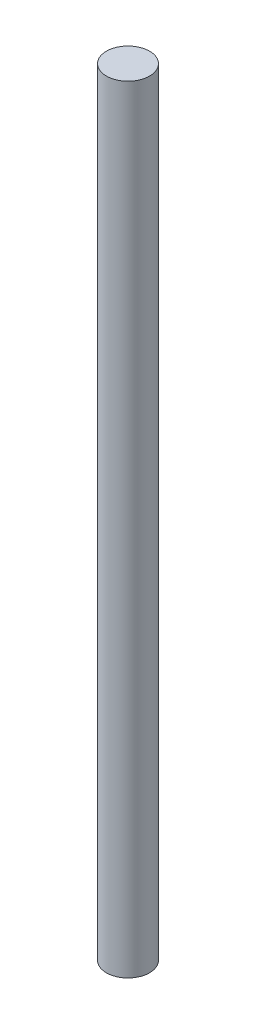
ISO-10303-21;
HEADER;
FILE_DESCRIPTION(('STEP AP214'),'2;1');
FILE_NAME('part.step','',(''),(''),'','','');
FILE_SCHEMA(('AUTOMOTIVE_DESIGN { 1 0 10303 214 1 1 1 1 }'));
ENDSEC;
DATA;
#1=APPLICATION_CONTEXT('core data for automotive mechanical design processes');
#2=APPLICATION_PROTOCOL_DEFINITION('international standard','automotive_design',2000,#1);
#3=PRODUCT_CONTEXT('',#1,'mechanical');
#4=PRODUCT('Part','Part','',(#3));
#5=PRODUCT_RELATED_PRODUCT_CATEGORY('part','',(#4));
#6=PRODUCT_DEFINITION_FORMATION('','',#4);
#7=PRODUCT_DEFINITION_CONTEXT('part definition',#1,'design');
#8=PRODUCT_DEFINITION('design','',#6,#7);
#9=PRODUCT_DEFINITION_SHAPE('','',#8);
#10=(LENGTH_UNIT() NAMED_UNIT(*) SI_UNIT(.MILLI.,.METRE.));
#11=(NAMED_UNIT(*) PLANE_ANGLE_UNIT() SI_UNIT($,.RADIAN.));
#12=(NAMED_UNIT(*) SI_UNIT($,.STERADIAN.) SOLID_ANGLE_UNIT());
#13=UNCERTAINTY_MEASURE_WITH_UNIT(LENGTH_MEASURE(1.E-05),#10,'distance_accuracy_value','');
#14=(GEOMETRIC_REPRESENTATION_CONTEXT(3) GLOBAL_UNCERTAINTY_ASSIGNED_CONTEXT((#13)) GLOBAL_UNIT_ASSIGNED_CONTEXT((#10,
#11,#12)) REPRESENTATION_CONTEXT('',''));
#15=CARTESIAN_POINT('',(0.,0.,0.));
#16=DIRECTION('',(0.,0.,1.));
#17=DIRECTION('',(1.,0.,0.));
#18=AXIS2_PLACEMENT_3D('',#15,#16,#17);
#19=CARTESIAN_POINT('',(0.,457.2,0.));
#20=DIRECTION('',(0.,-1.,0.));
#21=DIRECTION('',(0.,0.,-1.));
#22=AXIS2_PLACEMENT_3D('',#19,#20,#21);
#23=CYLINDRICAL_SURFACE('',#22,12.7);
#24=CARTESIAN_POINT('',(0.,457.2,0.));
#25=DIRECTION('',(0.,1.,0.));
#26=DIRECTION('',(0.,0.,1.));
#27=AXIS2_PLACEMENT_3D('',#24,#25,#26);
#28=CIRCLE('',#27,12.7);
#29=CARTESIAN_POINT('',(0.,457.2,12.7));
#30=VERTEX_POINT('',#29);
#31=EDGE_CURVE('E10',#30,#30,#28,.T.);
#32=ORIENTED_EDGE('',*,*,#31,.F.);
#33=EDGE_LOOP('',(#32));
#34=FACE_BOUND('',#33,.T.);
#35=CARTESIAN_POINT('',(0.,0.,0.));
#36=DIRECTION('',(0.,1.,0.));
#37=DIRECTION('',(0.,0.,1.));
#38=AXIS2_PLACEMENT_3D('',#35,#36,#37);
#39=CIRCLE('',#38,12.7);
#40=CARTESIAN_POINT('',(0.,0.,12.7));
#41=VERTEX_POINT('',#40);
#42=EDGE_CURVE('E34',#41,#41,#39,.T.);
#43=ORIENTED_EDGE('',*,*,#42,.T.);
#44=EDGE_LOOP('',(#43));
#45=FACE_BOUND('',#44,.T.);
#46=ADVANCED_FACE('F31',(#34,#45),#23,.T.);
#47=CARTESIAN_POINT('',(0.,457.2,0.));
#48=DIRECTION('',(0.,1.,0.));
#49=DIRECTION('',(0.,0.,1.));
#50=AXIS2_PLACEMENT_3D('',#47,#48,#49);
#51=PLANE('',#50);
#52=ORIENTED_EDGE('',*,*,#31,.T.);
#53=EDGE_LOOP('',(#52));
#54=FACE_BOUND('',#53,.T.);
#55=ADVANCED_FACE('F46',(#54),#51,.T.);
#56=CARTESIAN_POINT('',(0.,0.,0.));
#57=DIRECTION('',(0.,1.,0.));
#58=DIRECTION('',(0.,0.,1.));
#59=AXIS2_PLACEMENT_3D('',#56,#57,#58);
#60=PLANE('',#59);
#61=ORIENTED_EDGE('',*,*,#42,.F.);
#62=EDGE_LOOP('',(#61));
#63=FACE_BOUND('',#62,.T.);
#64=ADVANCED_FACE('F44',(#63),#60,.F.);
#65=CLOSED_SHELL('',(#46,#55,#64));
#66=MANIFOLD_SOLID_BREP('B2',#65);
#67=ADVANCED_BREP_SHAPE_REPRESENTATION('',(#18,#66),#14);
#68=SHAPE_DEFINITION_REPRESENTATION(#9,#67);
ENDSEC;
END-ISO-10303-21;
